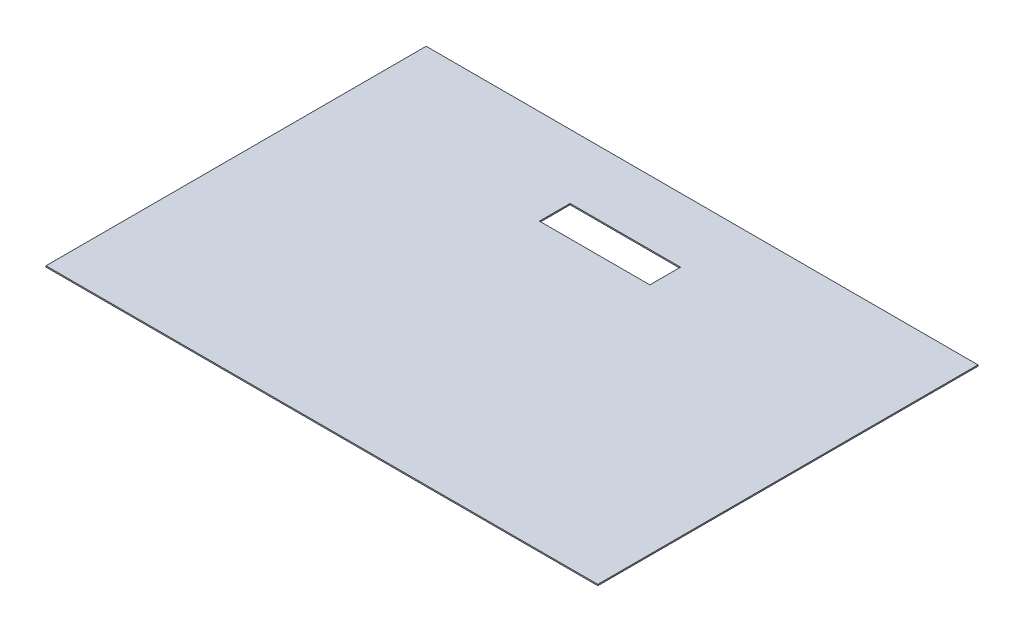
ISO-10303-21;
HEADER;
FILE_DESCRIPTION(('STEP AP214'),'2;1');
FILE_NAME('part.step','',(''),(''),'','','');
FILE_SCHEMA(('AUTOMOTIVE_DESIGN { 1 0 10303 214 1 1 1 1 }'));
ENDSEC;
DATA;
#1=APPLICATION_CONTEXT('core data for automotive mechanical design processes');
#2=APPLICATION_PROTOCOL_DEFINITION('international standard','automotive_design',2000,#1);
#3=PRODUCT_CONTEXT('',#1,'mechanical');
#4=PRODUCT('Part','Part','',(#3));
#5=PRODUCT_RELATED_PRODUCT_CATEGORY('part','',(#4));
#6=PRODUCT_DEFINITION_FORMATION('','',#4);
#7=PRODUCT_DEFINITION_CONTEXT('part definition',#1,'design');
#8=PRODUCT_DEFINITION('design','',#6,#7);
#9=PRODUCT_DEFINITION_SHAPE('','',#8);
#10=(LENGTH_UNIT() NAMED_UNIT(*) SI_UNIT(.MILLI.,.METRE.));
#11=(NAMED_UNIT(*) PLANE_ANGLE_UNIT() SI_UNIT($,.RADIAN.));
#12=(NAMED_UNIT(*) SI_UNIT($,.STERADIAN.) SOLID_ANGLE_UNIT());
#13=UNCERTAINTY_MEASURE_WITH_UNIT(LENGTH_MEASURE(1.E-05),#10,'distance_accuracy_value','');
#14=(GEOMETRIC_REPRESENTATION_CONTEXT(3) GLOBAL_UNCERTAINTY_ASSIGNED_CONTEXT((#13)) GLOBAL_UNIT_ASSIGNED_CONTEXT((#10,
#11,#12)) REPRESENTATION_CONTEXT('',''));
#15=CARTESIAN_POINT('',(0.,0.,0.));
#16=DIRECTION('',(0.,0.,1.));
#17=DIRECTION('',(1.,0.,0.));
#18=AXIS2_PLACEMENT_3D('',#15,#16,#17);
#19=CARTESIAN_POINT('',(0.,1.,0.));
#20=DIRECTION('',(0.,1.,0.));
#21=DIRECTION('',(0.,0.,1.));
#22=AXIS2_PLACEMENT_3D('',#19,#20,#21);
#23=PLANE('',#22);
#24=DIRECTION('',(0.,0.,-1.));
#25=VECTOR('',#24,1.);
#26=CARTESIAN_POINT('',(225.,1.,-155.));
#27=LINE('',#26,#25);
#28=CARTESIAN_POINT('',(225.,1.,155.));
#29=VERTEX_POINT('',#28);
#30=CARTESIAN_POINT('',(225.,1.,-155.));
#31=VERTEX_POINT('',#30);
#32=EDGE_CURVE('E138',#29,#31,#27,.T.);
#33=ORIENTED_EDGE('',*,*,#32,.T.);
#34=DIRECTION('',(-1.,0.,0.));
#35=VECTOR('',#34,1.);
#36=CARTESIAN_POINT('',(-225.,1.,-155.));
#37=LINE('',#36,#35);
#38=CARTESIAN_POINT('',(-225.,1.,-155.));
#39=VERTEX_POINT('',#38);
#40=EDGE_CURVE('E141',#31,#39,#37,.T.);
#41=ORIENTED_EDGE('',*,*,#40,.T.);
#42=DIRECTION('',(0.,0.,1.));
#43=VECTOR('',#42,1.);
#44=CARTESIAN_POINT('',(-225.,1.,-155.));
#45=LINE('',#44,#43);
#46=CARTESIAN_POINT('',(-225.,1.,155.));
#47=VERTEX_POINT('',#46);
#48=EDGE_CURVE('E144',#39,#47,#45,.T.);
#49=ORIENTED_EDGE('',*,*,#48,.T.);
#50=DIRECTION('',(1.,0.,0.));
#51=VECTOR('',#50,1.);
#52=CARTESIAN_POINT('',(-225.,1.,155.));
#53=LINE('',#52,#51);
#54=EDGE_CURVE('E146',#47,#29,#53,.T.);
#55=ORIENTED_EDGE('',*,*,#54,.T.);
#56=EDGE_LOOP('',(#33,#41,#49,#55));
#57=FACE_BOUND('',#56,.T.);
#58=DIRECTION('',(-1.,0.,0.));
#59=VECTOR('',#58,1.);
#60=CARTESIAN_POINT('',(-55.2910594005667,1.,-102.7));
#61=LINE('',#60,#59);
#62=CARTESIAN_POINT('',(34.7089405994333,1.,-102.7));
#63=VERTEX_POINT('',#62);
#64=CARTESIAN_POINT('',(-55.2910594005667,1.,-102.7));
#65=VERTEX_POINT('',#64);
#66=EDGE_CURVE('E110',#63,#65,#61,.T.);
#67=ORIENTED_EDGE('',*,*,#66,.F.);
#68=DIRECTION('',(0.,0.,-1.));
#69=VECTOR('',#68,1.);
#70=CARTESIAN_POINT('',(34.7089405994333,1.,-102.7));
#71=LINE('',#70,#69);
#72=CARTESIAN_POINT('',(34.7089405994333,1.,-77.7));
#73=VERTEX_POINT('',#72);
#74=EDGE_CURVE('E102',#73,#63,#71,.T.);
#75=ORIENTED_EDGE('',*,*,#74,.F.);
#76=DIRECTION('',(1.,0.,0.));
#77=VECTOR('',#76,1.);
#78=CARTESIAN_POINT('',(-55.2910594005667,1.,-77.7));
#79=LINE('',#78,#77);
#80=CARTESIAN_POINT('',(-55.2910594005667,1.,-77.7));
#81=VERTEX_POINT('',#80);
#82=EDGE_CURVE('E124',#81,#73,#79,.T.);
#83=ORIENTED_EDGE('',*,*,#82,.F.);
#84=DIRECTION('',(0.,0.,1.));
#85=VECTOR('',#84,1.);
#86=CARTESIAN_POINT('',(-55.2910594005667,1.,-102.7));
#87=LINE('',#86,#85);
#88=EDGE_CURVE('E122',#65,#81,#87,.T.);
#89=ORIENTED_EDGE('',*,*,#88,.F.);
#90=EDGE_LOOP('',(#67,#75,#83,#89));
#91=FACE_BOUND('',#90,.T.);
#92=ADVANCED_FACE('F37',(#57,#91),#23,.T.);
#93=CARTESIAN_POINT('',(0.,0.,0.));
#94=DIRECTION('',(0.,1.,0.));
#95=DIRECTION('',(0.,0.,1.));
#96=AXIS2_PLACEMENT_3D('',#93,#94,#95);
#97=PLANE('',#96);
#98=DIRECTION('',(0.,0.,-1.));
#99=VECTOR('',#98,1.);
#100=CARTESIAN_POINT('',(225.,0.,-155.));
#101=LINE('',#100,#99);
#102=CARTESIAN_POINT('',(225.,0.,155.));
#103=VERTEX_POINT('',#102);
#104=CARTESIAN_POINT('',(225.,0.,-155.));
#105=VERTEX_POINT('',#104);
#106=EDGE_CURVE('E118',#103,#105,#101,.T.);
#107=ORIENTED_EDGE('',*,*,#106,.F.);
#108=DIRECTION('',(1.,0.,0.));
#109=VECTOR('',#108,1.);
#110=CARTESIAN_POINT('',(-225.,0.,155.));
#111=LINE('',#110,#109);
#112=CARTESIAN_POINT('',(-225.,0.,155.));
#113=VERTEX_POINT('',#112);
#114=EDGE_CURVE('E142',#113,#103,#111,.T.);
#115=ORIENTED_EDGE('',*,*,#114,.F.);
#116=DIRECTION('',(0.,0.,1.));
#117=VECTOR('',#116,1.);
#118=CARTESIAN_POINT('',(-225.,0.,-155.));
#119=LINE('',#118,#117);
#120=CARTESIAN_POINT('',(-225.,0.,-155.));
#121=VERTEX_POINT('',#120);
#122=EDGE_CURVE('E153',#121,#113,#119,.T.);
#123=ORIENTED_EDGE('',*,*,#122,.F.);
#124=DIRECTION('',(-1.,0.,0.));
#125=VECTOR('',#124,1.);
#126=CARTESIAN_POINT('',(-225.,0.,-155.));
#127=LINE('',#126,#125);
#128=EDGE_CURVE('E151',#105,#121,#127,.T.);
#129=ORIENTED_EDGE('',*,*,#128,.F.);
#130=EDGE_LOOP('',(#107,#115,#123,#129));
#131=FACE_BOUND('',#130,.T.);
#132=DIRECTION('',(0.,0.,-1.));
#133=VECTOR('',#132,1.);
#134=CARTESIAN_POINT('',(34.7089405994333,0.,-102.7));
#135=LINE('',#134,#133);
#136=CARTESIAN_POINT('',(34.7089405994333,0.,-77.7));
#137=VERTEX_POINT('',#136);
#138=CARTESIAN_POINT('',(34.7089405994333,0.,-102.7));
#139=VERTEX_POINT('',#138);
#140=EDGE_CURVE('E60',#137,#139,#135,.T.);
#141=ORIENTED_EDGE('',*,*,#140,.T.);
#142=DIRECTION('',(-1.,0.,0.));
#143=VECTOR('',#142,1.);
#144=CARTESIAN_POINT('',(-55.2910594005667,0.,-102.7));
#145=LINE('',#144,#143);
#146=CARTESIAN_POINT('',(-55.2910594005667,0.,-102.7));
#147=VERTEX_POINT('',#146);
#148=EDGE_CURVE('E117',#139,#147,#145,.T.);
#149=ORIENTED_EDGE('',*,*,#148,.T.);
#150=DIRECTION('',(0.,0.,1.));
#151=VECTOR('',#150,1.);
#152=CARTESIAN_POINT('',(-55.2910594005667,0.,-102.7));
#153=LINE('',#152,#151);
#154=CARTESIAN_POINT('',(-55.2910594005667,0.,-77.7));
#155=VERTEX_POINT('',#154);
#156=EDGE_CURVE('E130',#147,#155,#153,.T.);
#157=ORIENTED_EDGE('',*,*,#156,.T.);
#158=DIRECTION('',(1.,0.,0.));
#159=VECTOR('',#158,1.);
#160=CARTESIAN_POINT('',(-55.2910594005667,0.,-77.7));
#161=LINE('',#160,#159);
#162=EDGE_CURVE('E111',#155,#137,#161,.T.);
#163=ORIENTED_EDGE('',*,*,#162,.T.);
#164=EDGE_LOOP('',(#141,#149,#157,#163));
#165=FACE_BOUND('',#164,.T.);
#166=ADVANCED_FACE('F171',(#131,#165),#97,.F.);
#167=CARTESIAN_POINT('',(225.,1.,-155.));
#168=DIRECTION('',(-1.,0.,0.));
#169=DIRECTION('',(0.,0.,1.));
#170=AXIS2_PLACEMENT_3D('',#167,#168,#169);
#171=PLANE('',#170);
#172=ORIENTED_EDGE('',*,*,#106,.T.);
#173=DIRECTION('',(0.,-1.,0.));
#174=VECTOR('',#173,1.);
#175=CARTESIAN_POINT('',(225.,1.,-155.));
#176=LINE('',#175,#174);
#177=EDGE_CURVE('E11',#31,#105,#176,.T.);
#178=ORIENTED_EDGE('',*,*,#177,.F.);
#179=ORIENTED_EDGE('',*,*,#32,.F.);
#180=DIRECTION('',(0.,-1.,0.));
#181=VECTOR('',#180,1.);
#182=CARTESIAN_POINT('',(225.,1.,155.));
#183=LINE('',#182,#181);
#184=EDGE_CURVE('E148',#29,#103,#183,.T.);
#185=ORIENTED_EDGE('',*,*,#184,.T.);
#186=EDGE_LOOP('',(#172,#178,#179,#185));
#187=FACE_BOUND('',#186,.T.);
#188=ADVANCED_FACE('F39',(#187),#171,.F.);
#189=CARTESIAN_POINT('',(-225.,1.,-155.));
#190=DIRECTION('',(0.,0.,1.));
#191=DIRECTION('',(1.,0.,0.));
#192=AXIS2_PLACEMENT_3D('',#189,#190,#191);
#193=PLANE('',#192);
#194=ORIENTED_EDGE('',*,*,#128,.T.);
#195=DIRECTION('',(0.,-1.,0.));
#196=VECTOR('',#195,1.);
#197=CARTESIAN_POINT('',(-225.,1.,-155.));
#198=LINE('',#197,#196);
#199=EDGE_CURVE('E45',#39,#121,#198,.T.);
#200=ORIENTED_EDGE('',*,*,#199,.F.);
#201=ORIENTED_EDGE('',*,*,#40,.F.);
#202=ORIENTED_EDGE('',*,*,#177,.T.);
#203=EDGE_LOOP('',(#194,#200,#201,#202));
#204=FACE_BOUND('',#203,.T.);
#205=ADVANCED_FACE('F181',(#204),#193,.F.);
#206=CARTESIAN_POINT('',(-225.,1.,-155.));
#207=DIRECTION('',(1.,0.,0.));
#208=DIRECTION('',(0.,0.,-1.));
#209=AXIS2_PLACEMENT_3D('',#206,#207,#208);
#210=PLANE('',#209);
#211=ORIENTED_EDGE('',*,*,#122,.T.);
#212=DIRECTION('',(0.,-1.,0.));
#213=VECTOR('',#212,1.);
#214=CARTESIAN_POINT('',(-225.,1.,155.));
#215=LINE('',#214,#213);
#216=EDGE_CURVE('E158',#47,#113,#215,.T.);
#217=ORIENTED_EDGE('',*,*,#216,.F.);
#218=ORIENTED_EDGE('',*,*,#48,.F.);
#219=ORIENTED_EDGE('',*,*,#199,.T.);
#220=EDGE_LOOP('',(#211,#217,#218,#219));
#221=FACE_BOUND('',#220,.T.);
#222=ADVANCED_FACE('F165',(#221),#210,.F.);
#223=CARTESIAN_POINT('',(-225.,1.,155.));
#224=DIRECTION('',(0.,0.,-1.));
#225=DIRECTION('',(-1.,0.,0.));
#226=AXIS2_PLACEMENT_3D('',#223,#224,#225);
#227=PLANE('',#226);
#228=ORIENTED_EDGE('',*,*,#114,.T.);
#229=ORIENTED_EDGE('',*,*,#184,.F.);
#230=ORIENTED_EDGE('',*,*,#54,.F.);
#231=ORIENTED_EDGE('',*,*,#216,.T.);
#232=EDGE_LOOP('',(#228,#229,#230,#231));
#233=FACE_BOUND('',#232,.T.);
#234=ADVANCED_FACE('F175',(#233),#227,.F.);
#235=CARTESIAN_POINT('',(34.7089405994333,1.,-102.7));
#236=DIRECTION('',(-1.,0.,0.));
#237=DIRECTION('',(0.,0.,1.));
#238=AXIS2_PLACEMENT_3D('',#235,#236,#237);
#239=PLANE('',#238);
#240=ORIENTED_EDGE('',*,*,#140,.F.);
#241=DIRECTION('',(0.,-1.,0.));
#242=VECTOR('',#241,1.);
#243=CARTESIAN_POINT('',(34.7089405994333,1.,-77.7));
#244=LINE('',#243,#242);
#245=EDGE_CURVE('E106',#73,#137,#244,.T.);
#246=ORIENTED_EDGE('',*,*,#245,.F.);
#247=ORIENTED_EDGE('',*,*,#74,.T.);
#248=DIRECTION('',(0.,-1.,0.));
#249=VECTOR('',#248,1.);
#250=CARTESIAN_POINT('',(34.7089405994333,1.,-102.7));
#251=LINE('',#250,#249);
#252=EDGE_CURVE('E105',#63,#139,#251,.T.);
#253=ORIENTED_EDGE('',*,*,#252,.T.);
#254=EDGE_LOOP('',(#240,#246,#247,#253));
#255=FACE_BOUND('',#254,.T.);
#256=ADVANCED_FACE('F104',(#255),#239,.T.);
#257=CARTESIAN_POINT('',(-55.2910594005667,1.,-102.7));
#258=DIRECTION('',(0.,0.,1.));
#259=DIRECTION('',(1.,0.,0.));
#260=AXIS2_PLACEMENT_3D('',#257,#258,#259);
#261=PLANE('',#260);
#262=ORIENTED_EDGE('',*,*,#148,.F.);
#263=ORIENTED_EDGE('',*,*,#252,.F.);
#264=ORIENTED_EDGE('',*,*,#66,.T.);
#265=DIRECTION('',(0.,-1.,0.));
#266=VECTOR('',#265,1.);
#267=CARTESIAN_POINT('',(-55.2910594005667,1.,-102.7));
#268=LINE('',#267,#266);
#269=EDGE_CURVE('E119',#65,#147,#268,.T.);
#270=ORIENTED_EDGE('',*,*,#269,.T.);
#271=EDGE_LOOP('',(#262,#263,#264,#270));
#272=FACE_BOUND('',#271,.T.);
#273=ADVANCED_FACE('F114',(#272),#261,.T.);
#274=CARTESIAN_POINT('',(-55.2910594005667,1.,-102.7));
#275=DIRECTION('',(1.,0.,0.));
#276=DIRECTION('',(0.,0.,-1.));
#277=AXIS2_PLACEMENT_3D('',#274,#275,#276);
#278=PLANE('',#277);
#279=ORIENTED_EDGE('',*,*,#156,.F.);
#280=ORIENTED_EDGE('',*,*,#269,.F.);
#281=ORIENTED_EDGE('',*,*,#88,.T.);
#282=DIRECTION('',(0.,-1.,0.));
#283=VECTOR('',#282,1.);
#284=CARTESIAN_POINT('',(-55.2910594005667,1.,-77.7));
#285=LINE('',#284,#283);
#286=EDGE_CURVE('E52',#81,#155,#285,.T.);
#287=ORIENTED_EDGE('',*,*,#286,.T.);
#288=EDGE_LOOP('',(#279,#280,#281,#287));
#289=FACE_BOUND('',#288,.T.);
#290=ADVANCED_FACE('F204',(#289),#278,.T.);
#291=CARTESIAN_POINT('',(-55.2910594005667,1.,-77.7));
#292=DIRECTION('',(0.,0.,-1.));
#293=DIRECTION('',(-1.,0.,0.));
#294=AXIS2_PLACEMENT_3D('',#291,#292,#293);
#295=PLANE('',#294);
#296=ORIENTED_EDGE('',*,*,#162,.F.);
#297=ORIENTED_EDGE('',*,*,#286,.F.);
#298=ORIENTED_EDGE('',*,*,#82,.T.);
#299=ORIENTED_EDGE('',*,*,#245,.T.);
#300=EDGE_LOOP('',(#296,#297,#298,#299));
#301=FACE_BOUND('',#300,.T.);
#302=ADVANCED_FACE('F208',(#301),#295,.T.);
#303=CLOSED_SHELL('',(#92,#166,#188,#205,#222,#234,#256,#273,#290,#302));
#304=MANIFOLD_SOLID_BREP('B2',#303);
#305=ADVANCED_BREP_SHAPE_REPRESENTATION('',(#18,#304),#14);
#306=SHAPE_DEFINITION_REPRESENTATION(#9,#305);
ENDSEC;
END-ISO-10303-21;
